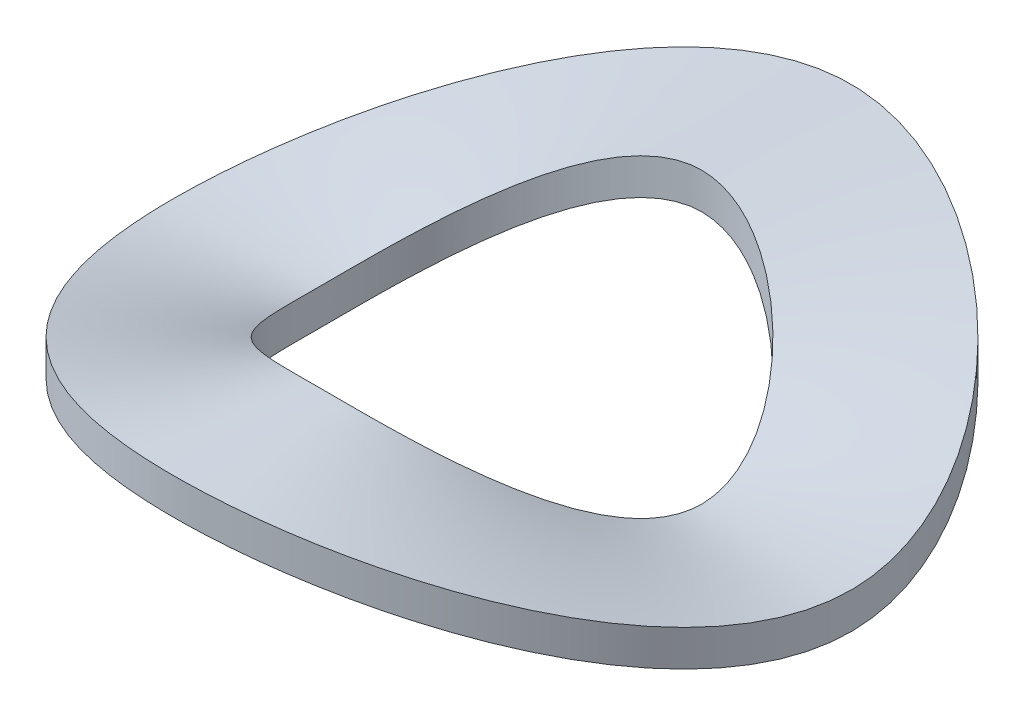
ISO-10303-21;
HEADER;
FILE_DESCRIPTION(('STEP AP214'),'2;1');
FILE_NAME('part.step','',(''),(''),'','','');
FILE_SCHEMA(('AUTOMOTIVE_DESIGN { 1 0 10303 214 1 1 1 1 }'));
ENDSEC;
DATA;
#1=APPLICATION_CONTEXT('core data for automotive mechanical design processes');
#2=APPLICATION_PROTOCOL_DEFINITION('international standard','automotive_design',2000,#1);
#3=PRODUCT_CONTEXT('',#1,'mechanical');
#4=PRODUCT('Part','Part','',(#3));
#5=PRODUCT_RELATED_PRODUCT_CATEGORY('part','',(#4));
#6=PRODUCT_DEFINITION_FORMATION('','',#4);
#7=PRODUCT_DEFINITION_CONTEXT('part definition',#1,'design');
#8=PRODUCT_DEFINITION('design','',#6,#7);
#9=PRODUCT_DEFINITION_SHAPE('','',#8);
#10=(LENGTH_UNIT() NAMED_UNIT(*) SI_UNIT(.MILLI.,.METRE.));
#11=(NAMED_UNIT(*) PLANE_ANGLE_UNIT() SI_UNIT($,.RADIAN.));
#12=(NAMED_UNIT(*) SI_UNIT($,.STERADIAN.) SOLID_ANGLE_UNIT());
#13=UNCERTAINTY_MEASURE_WITH_UNIT(LENGTH_MEASURE(1.E-05),#10,'distance_accuracy_value','');
#14=(GEOMETRIC_REPRESENTATION_CONTEXT(3) GLOBAL_UNCERTAINTY_ASSIGNED_CONTEXT((#13)) GLOBAL_UNIT_ASSIGNED_CONTEXT((#10,
#11,#12)) REPRESENTATION_CONTEXT('',''));
#15=CARTESIAN_POINT('',(0.,0.,0.));
#16=DIRECTION('',(0.,0.,1.));
#17=DIRECTION('',(1.,0.,0.));
#18=AXIS2_PLACEMENT_3D('',#15,#16,#17);
#19=CARTESIAN_POINT('',(-4.2,0.8,0.));
#20=CARTESIAN_POINT('',(-4.20000000000264,0.799999999998755,-0.104999999999411));
#21=CARTESIAN_POINT('',(-4.18950000000846,0.810999999996081,-0.31499999999814));
#22=CARTESIAN_POINT('',(-4.14382500001857,0.857199999991654,-0.628424999996024));
#23=CARTESIAN_POINT('',(-4.06980000002988,0.929799999986951,-0.938699999993765));
#24=CARTESIAN_POINT('',(-3.46500000008107,1.50399999997936,-2.77200000004827));
#25=CARTESIAN_POINT('',(0.419999999789683,4.76000000000312,-5.87999999999378));
#26=CARTESIAN_POINT('',(6.30000000003531,-1.39999999996301,8.39617004394499E-11));
#27=CARTESIAN_POINT('',(0.419999999956076,4.75999999999689,5.88000000000151));
#28=CARTESIAN_POINT('',(-3.46499999996412,1.50400000002064,2.77199999999058));
#29=CARTESIAN_POINT('',(-4.06979999998262,0.929800000008906,0.938699999995853));
#30=CARTESIAN_POINT('',(-4.14382499998694,0.857200000006478,0.628424999996966));
#31=CARTESIAN_POINT('',(-4.1894999999926,0.811000000003549,0.314999999998328));
#32=CARTESIAN_POINT('',(-4.19999999999736,0.800000000001245,0.104999999999411));
#33=CARTESIAN_POINT('',(-4.2,0.8,0.));
#34=CARTESIAN_POINT('',(-4.2,0.733333333333334,0.));
#35=CARTESIAN_POINT('',(-4.20000000000264,0.733333333332089,-0.104999999999411));
#36=CARTESIAN_POINT('',(-4.18950000000846,0.744333333329415,-0.31499999999814));
#37=CARTESIAN_POINT('',(-4.14382500001857,0.790533333324988,-0.628424999996024));
#38=CARTESIAN_POINT('',(-4.06980000002988,0.863133333320284,-0.938699999993765));
#39=CARTESIAN_POINT('',(-3.46500000008107,1.4373333333127,-2.77200000004827));
#40=CARTESIAN_POINT('',(0.419999999789683,4.69333333333645,-5.87999999999378));
#41=CARTESIAN_POINT('',(6.30000000003531,-1.46666666662968,8.39617004394499E-11));
#42=CARTESIAN_POINT('',(0.419999999956076,4.69333333333022,5.88000000000151));
#43=CARTESIAN_POINT('',(-3.46499999996412,1.43733333335397,2.77199999999058));
#44=CARTESIAN_POINT('',(-4.06979999998262,0.86313333334224,0.938699999995853));
#45=CARTESIAN_POINT('',(-4.14382499998694,0.790533333339811,0.628424999996966));
#46=CARTESIAN_POINT('',(-4.1894999999926,0.744333333336883,0.314999999998328));
#47=CARTESIAN_POINT('',(-4.19999999999736,0.733333333334578,0.104999999999411));
#48=CARTESIAN_POINT('',(-4.2,0.733333333333334,0.));
#49=CARTESIAN_POINT('',(-4.2,0.600000000000001,0.));
#50=CARTESIAN_POINT('',(-4.20000000000264,0.599999999998756,-0.104999999999411));
#51=CARTESIAN_POINT('',(-4.18950000000846,0.610999999996081,-0.314999999998139));
#52=CARTESIAN_POINT('',(-4.14382500001857,0.657199999991654,-0.628424999996023));
#53=CARTESIAN_POINT('',(-4.06980000002988,0.729799999986951,-0.938699999993764));
#54=CARTESIAN_POINT('',(-3.46500000008107,1.30399999997936,-2.77200000004826));
#55=CARTESIAN_POINT('',(0.419999999789683,4.56000000000312,-5.87999999999378));
#56=CARTESIAN_POINT('',(6.30000000003531,-1.59999999996301,8.39619443849388E-11));
#57=CARTESIAN_POINT('',(0.419999999956076,4.55999999999689,5.8800000000015));
#58=CARTESIAN_POINT('',(-3.46499999996412,1.30400000002064,2.77199999999057));
#59=CARTESIAN_POINT('',(-4.06979999998262,0.729800000008907,0.938699999995852));
#60=CARTESIAN_POINT('',(-4.14382499998694,0.657200000006478,0.628424999996966));
#61=CARTESIAN_POINT('',(-4.1894999999926,0.61100000000355,0.314999999998328));
#62=CARTESIAN_POINT('',(-4.19999999999736,0.600000000001245,0.104999999999411));
#63=CARTESIAN_POINT('',(-4.2,0.600000000000001,0.));
#64=CARTESIAN_POINT('',(-4.20000000000001,0.400000000000001,0.));
#65=CARTESIAN_POINT('',(-4.20000000000265,0.399999999998756,-0.104999999999411));
#66=CARTESIAN_POINT('',(-4.18950000000846,0.410999999996082,-0.31499999999814));
#67=CARTESIAN_POINT('',(-4.14382500001858,0.457199999991655,-0.628424999996025));
#68=CARTESIAN_POINT('',(-4.06980000002988,0.529799999986951,-0.938699999993767));
#69=CARTESIAN_POINT('',(-3.46500000008108,1.10399999997936,-2.77200000004827));
#70=CARTESIAN_POINT('',(0.419999999789684,4.36000000000312,-5.87999999999379));
#71=CARTESIAN_POINT('',(6.30000000003532,-1.79999999996301,8.39617546495586E-11));
#72=CARTESIAN_POINT('',(0.419999999956077,4.35999999999689,5.88000000000152));
#73=CARTESIAN_POINT('',(-3.46499999996413,1.10400000002064,2.77199999999058));
#74=CARTESIAN_POINT('',(-4.06979999998263,0.529800000008907,0.938699999995855));
#75=CARTESIAN_POINT('',(-4.14382499998694,0.457200000006479,0.628424999996968));
#76=CARTESIAN_POINT('',(-4.18949999999261,0.41100000000355,0.314999999998329));
#77=CARTESIAN_POINT('',(-4.19999999999736,0.400000000001246,0.104999999999412));
#78=CARTESIAN_POINT('',(-4.20000000000001,0.400000000000001,0.));
#79=CARTESIAN_POINT('',(-4.2,0.2,0.));
#80=CARTESIAN_POINT('',(-4.20000000000264,0.199999999998756,-0.104999999999411));
#81=CARTESIAN_POINT('',(-4.18950000000845,0.210999999996081,-0.314999999998139));
#82=CARTESIAN_POINT('',(-4.14382500001857,0.257199999991654,-0.628424999996023));
#83=CARTESIAN_POINT('',(-4.06980000002987,0.329799999986951,-0.938699999993763));
#84=CARTESIAN_POINT('',(-3.46500000008107,0.903999999979364,-2.77200000004826));
#85=CARTESIAN_POINT('',(0.419999999789683,4.16000000000312,-5.87999999999377));
#86=CARTESIAN_POINT('',(6.3000000000353,-1.99999999996301,8.39620799102103E-11));
#87=CARTESIAN_POINT('',(0.419999999956076,4.15999999999689,5.8800000000015));
#88=CARTESIAN_POINT('',(-3.46499999996412,0.904000000020638,2.77199999999057));
#89=CARTESIAN_POINT('',(-4.06979999998262,0.329800000008907,0.938699999995852));
#90=CARTESIAN_POINT('',(-4.14382499998693,0.257200000006478,0.628424999996965));
#91=CARTESIAN_POINT('',(-4.1894999999926,0.211000000003549,0.314999999998327));
#92=CARTESIAN_POINT('',(-4.19999999999735,0.200000000001245,0.104999999999411));
#93=CARTESIAN_POINT('',(-4.2,0.2,0.));
#94=CARTESIAN_POINT('',(-4.2,0.0666666666666672,0.));
#95=CARTESIAN_POINT('',(-4.20000000000264,0.0666666666654225,-0.104999999999411));
#96=CARTESIAN_POINT('',(-4.18950000000846,0.0776666666627481,-0.31499999999814));
#97=CARTESIAN_POINT('',(-4.14382500001857,0.123866666658321,-0.628424999996024));
#98=CARTESIAN_POINT('',(-4.06980000002988,0.196466666653618,-0.938699999993765));
#99=CARTESIAN_POINT('',(-3.46500000008107,0.77066666664603,-2.77200000004826));
#100=CARTESIAN_POINT('',(0.419999999789683,4.02666666666978,-5.87999999999378));
#101=CARTESIAN_POINT('',(6.30000000003531,-2.13333333329634,8.39617817546129E-11));
#102=CARTESIAN_POINT('',(0.419999999956076,4.02666666666355,5.88000000000151));
#103=CARTESIAN_POINT('',(-3.46499999996412,0.770666666687305,2.77199999999058));
#104=CARTESIAN_POINT('',(-4.06979999998262,0.196466666675574,0.938699999995853));
#105=CARTESIAN_POINT('',(-4.14382499998694,0.123866666673145,0.628424999996966));
#106=CARTESIAN_POINT('',(-4.1894999999926,0.0776666666702162,0.314999999998328));
#107=CARTESIAN_POINT('',(-4.19999999999736,0.0666666666679119,0.104999999999411));
#108=CARTESIAN_POINT('',(-4.2,0.0666666666666672,0.));
#109=CARTESIAN_POINT('',(-4.2,0.,0.));
#110=CARTESIAN_POINT('',(-4.20000000000264,-1.24442988940344E-12,-0.104999999999411));
#111=CARTESIAN_POINT('',(-4.18950000000846,0.0109999999960812,-0.31499999999814));
#112=CARTESIAN_POINT('',(-4.14382500001857,0.057199999991654,-0.628424999996024));
#113=CARTESIAN_POINT('',(-4.06980000002988,0.129799999986951,-0.938699999993765));
#114=CARTESIAN_POINT('',(-3.46500000008107,0.703999999979363,-2.77200000004826));
#115=CARTESIAN_POINT('',(0.419999999789683,3.96000000000312,-5.87999999999378));
#116=CARTESIAN_POINT('',(6.30000000003531,-2.19999999996301,8.39617817546129E-11));
#117=CARTESIAN_POINT('',(0.419999999956076,3.95999999999689,5.88000000000151));
#118=CARTESIAN_POINT('',(-3.46499999996412,0.704000000020638,2.77199999999058));
#119=CARTESIAN_POINT('',(-4.06979999998262,0.129800000008907,0.938699999995853));
#120=CARTESIAN_POINT('',(-4.14382499998694,0.0572000000064783,0.628424999996966));
#121=CARTESIAN_POINT('',(-4.1894999999926,0.0110000000035493,0.314999999998328));
#122=CARTESIAN_POINT('',(-4.19999999999736,1.24494488543537E-12,0.104999999999411));
#123=CARTESIAN_POINT('',(-4.2,0.,0.));
#124=B_SPLINE_SURFACE_WITH_KNOTS('',3,3,((#19,#20,#21,#22,#23,#24,#25,#26,#27,#28,#29,#30,#31,
#32,#33),(#34,#35,#36,#37,#38,#39,#40,#41,#42,#43,#44,#45,#46,#47,#48),(#49,#50,#51,#52,#53,#54,
#55,#56,#57,#58,#59,#60,#61,#62,#63),(#64,#65,#66,#67,#68,#69,#70,#71,#72,#73,#74,#75,#76,#77,
#78),(#79,#80,#81,#82,#83,#84,#85,#86,#87,#88,#89,#90,#91,#92,#93),(#94,#95,#96,#97,#98,#99,
#100,#101,#102,#103,#104,#105,#106,#107,#108),(#109,#110,#111,#112,#113,#114,#115,#116,#117,
#118,#119,#120,#121,#122,#123)),.UNSPECIFIED.,.F.,.T.,.F.,(4,1,1,1,4),(4,1,1,1,1,1,1,1,1,1,1,1,
4),(0.836734693877551,0.877551020408163,0.918367346938775,0.959183673469388,1.),(0.,0.0125,
0.0249999999999999,0.0375000000000001,0.05,0.250000000008407,0.500000000000158,0.75,0.95,0.9625,
0.975,0.9875,1.),.UNSPECIFIED.);
#125=CARTESIAN_POINT('',(-4.2,0.,0.));
#126=CARTESIAN_POINT('',(-4.20000000000264,-1.24442988940344E-12,-0.104999999999411));
#127=CARTESIAN_POINT('',(-4.18950000000846,0.0109999999960812,-0.31499999999814));
#128=CARTESIAN_POINT('',(-4.14382500001857,0.057199999991654,-0.628424999996024));
#129=CARTESIAN_POINT('',(-4.06980000002988,0.129799999986951,-0.938699999993765));
#130=CARTESIAN_POINT('',(-3.46500000008107,0.703999999979363,-2.77200000004826));
#131=CARTESIAN_POINT('',(0.419999999789683,3.96000000000312,-5.87999999999378));
#132=CARTESIAN_POINT('',(6.30000000003531,-2.19999999996301,8.39617817546129E-11));
#133=CARTESIAN_POINT('',(0.419999999956076,3.95999999999689,5.88000000000151));
#134=CARTESIAN_POINT('',(-3.46499999996412,0.704000000020638,2.77199999999058));
#135=CARTESIAN_POINT('',(-4.06979999998262,0.129800000008907,0.938699999995853));
#136=CARTESIAN_POINT('',(-4.14382499998694,0.0572000000064783,0.628424999996966));
#137=CARTESIAN_POINT('',(-4.1894999999926,0.0110000000035493,0.314999999998328));
#138=CARTESIAN_POINT('',(-4.19999999999736,1.24494488543537E-12,0.104999999999411));
#139=CARTESIAN_POINT('',(-4.2,0.,0.));
#140=B_SPLINE_CURVE_WITH_KNOTS('',3,(#125,#126,#127,#128,#129,#130,#131,#132,#133,#134,#135,
#136,#137,#138,#139),.UNSPECIFIED.,.T.,.F.,(4,1,1,1,1,1,1,1,1,1,1,1,4),(0.,0.0125,
0.0249999999999999,0.0375000000000001,0.05,0.250000000008407,0.500000000000158,0.75,0.95,0.9625,
0.975,0.9875,1.),.UNSPECIFIED.);
#141=CARTESIAN_POINT('',(-4.2,0.,0.));
#142=VERTEX_POINT('',#141);
#143=EDGE_CURVE('E11',#142,#142,#140,.T.);
#144=CARTESIAN_POINT('',(-4.2,0.8,0.));
#145=CARTESIAN_POINT('',(-4.20000000000264,0.799999999998755,-0.104999999999411));
#146=CARTESIAN_POINT('',(-4.18950000000846,0.810999999996081,-0.31499999999814));
#147=CARTESIAN_POINT('',(-4.14382500001857,0.857199999991654,-0.628424999996024));
#148=CARTESIAN_POINT('',(-4.06980000002988,0.929799999986951,-0.938699999993765));
#149=CARTESIAN_POINT('',(-3.46500000008107,1.50399999997936,-2.77200000004827));
#150=CARTESIAN_POINT('',(0.419999999789683,4.76000000000312,-5.87999999999378));
#151=CARTESIAN_POINT('',(6.30000000003531,-1.39999999996301,8.39617004394499E-11));
#152=CARTESIAN_POINT('',(0.419999999956076,4.75999999999689,5.88000000000151));
#153=CARTESIAN_POINT('',(-3.46499999996412,1.50400000002064,2.77199999999058));
#154=CARTESIAN_POINT('',(-4.06979999998262,0.929800000008906,0.938699999995853));
#155=CARTESIAN_POINT('',(-4.14382499998694,0.857200000006478,0.628424999996966));
#156=CARTESIAN_POINT('',(-4.1894999999926,0.811000000003549,0.314999999998328));
#157=CARTESIAN_POINT('',(-4.19999999999736,0.800000000001245,0.104999999999411));
#158=CARTESIAN_POINT('',(-4.2,0.8,0.));
#159=B_SPLINE_CURVE_WITH_KNOTS('',3,(#144,#145,#146,#147,#148,#149,#150,#151,#152,#153,#154,
#155,#156,#157,#158),.UNSPECIFIED.,.T.,.F.,(4,1,1,1,1,1,1,1,1,1,1,1,4),(0.,0.0125,
0.0249999999999999,0.0375000000000001,0.05,0.250000000008407,0.500000000000158,0.75,0.95,0.9625,
0.975,0.9875,1.),.UNSPECIFIED.);
#160=CARTESIAN_POINT('',(-4.2,0.8,0.));
#161=VERTEX_POINT('',#160);
#162=EDGE_CURVE('E59',#161,#161,#159,.T.);
#163=ORIENTED_EDGE('',*,*,#143,.T.);
#164=EDGE_LOOP('',(#163));
#165=FACE_BOUND('',#164,.T.);
#166=ORIENTED_EDGE('',*,*,#162,.F.);
#167=EDGE_LOOP('',(#166));
#168=FACE_BOUND('',#167,.T.);
#169=ADVANCED_FACE('F48',(#165,#168),#124,.T.);
#170=CARTESIAN_POINT('',(-7.5,0.800000000000001,0.));
#171=CARTESIAN_POINT('',(-7.50000000000472,0.799999999998756,-0.187499999998948));
#172=CARTESIAN_POINT('',(-7.4812500000151,0.810999999996081,-0.562499999996679));
#173=CARTESIAN_POINT('',(-7.39968750003316,0.857199999991654,-1.1221874999929));
#174=CARTESIAN_POINT('',(-7.26750000005335,0.929799999986951,-1.67624999998887));
#175=CARTESIAN_POINT('',(-6.18750000014477,1.50399999997936,-4.95000000008619));
#176=CARTESIAN_POINT('',(0.749999999624434,4.76000000000312,-10.4999999999889));
#177=CARTESIAN_POINT('',(11.2500000000631,-1.39999999996301,1.49931662137698E-10));
#178=CARTESIAN_POINT('',(0.749999999921565,4.75999999999689,10.5000000000027));
#179=CARTESIAN_POINT('',(-6.18749999993593,1.50400000002064,4.94999999998317));
#180=CARTESIAN_POINT('',(-7.26749999996897,0.929800000008907,1.67624999999259));
#181=CARTESIAN_POINT('',(-7.39968749997667,0.857200000006478,1.12218749999458));
#182=CARTESIAN_POINT('',(-7.48124999998678,0.81100000000355,0.562499999997013));
#183=CARTESIAN_POINT('',(-7.49999999999528,0.800000000001245,0.187499999998948));
#184=CARTESIAN_POINT('',(-7.5,0.800000000000001,0.));
#185=CARTESIAN_POINT('',(-7.225,0.800000000000001,0.));
#186=CARTESIAN_POINT('',(-7.22500000000454,0.799999999998756,-0.180624999998987));
#187=CARTESIAN_POINT('',(-7.20693750001455,0.810999999996081,-0.5418749999968));
#188=CARTESIAN_POINT('',(-7.12836562503195,0.857199999991654,-1.08104062499316));
#189=CARTESIAN_POINT('',(-7.00102500005139,0.929799999986951,-1.61478749998927));
#190=CARTESIAN_POINT('',(-5.96062500013947,1.50399999997936,-4.76850000008303));
#191=CARTESIAN_POINT('',(0.722499999638205,4.76000000000312,-10.1149999999893));
#192=CARTESIAN_POINT('',(10.8375000000607,-1.39999999996301,1.44434865543414E-10));
#193=CARTESIAN_POINT('',(0.722499999924441,4.75999999999689,10.1150000000026));
#194=CARTESIAN_POINT('',(-5.96062499993828,1.50400000002064,4.76849999998379));
#195=CARTESIAN_POINT('',(-7.00102499997011,0.929800000008907,1.61478749999287));
#196=CARTESIAN_POINT('',(-7.12836562497753,0.857200000006478,1.08104062499478));
#197=CARTESIAN_POINT('',(-7.20693749998727,0.81100000000355,0.541874999997123));
#198=CARTESIAN_POINT('',(-7.22499999999545,0.800000000001245,0.180624999998987));
#199=CARTESIAN_POINT('',(-7.225,0.800000000000001,0.));
#200=CARTESIAN_POINT('',(-6.675,0.8,0.));
#201=CARTESIAN_POINT('',(-6.6750000000042,0.799999999998755,-0.166874999999064));
#202=CARTESIAN_POINT('',(-6.65831250001344,0.810999999996081,-0.500624999997044));
#203=CARTESIAN_POINT('',(-6.58572187502952,0.857199999991654,-0.998746874993681));
#204=CARTESIAN_POINT('',(-6.46807500004748,0.929799999986951,-1.49186249999009));
#205=CARTESIAN_POINT('',(-5.50687500012885,1.50399999997936,-4.40550000007671));
#206=CARTESIAN_POINT('',(0.667499999665747,4.76000000000312,-9.34499999999012));
#207=CARTESIAN_POINT('',(10.0125000000561,-1.39999999996301,1.33439591841478E-10));
#208=CARTESIAN_POINT('',(0.667499999930193,4.75999999999689,9.3450000000024));
#209=CARTESIAN_POINT('',(-5.50687499994298,1.50400000002064,4.40549999998502));
#210=CARTESIAN_POINT('',(-6.46807499997238,0.929800000008906,1.49186249999341));
#211=CARTESIAN_POINT('',(-6.58572187497924,0.857200000006478,0.998746874995178));
#212=CARTESIAN_POINT('',(-6.65831249998824,0.811000000003549,0.500624999997342));
#213=CARTESIAN_POINT('',(-6.6749999999958,0.800000000001244,0.166874999999064));
#214=CARTESIAN_POINT('',(-6.675,0.8,0.));
#215=CARTESIAN_POINT('',(-5.85,0.800000000000001,0.));
#216=CARTESIAN_POINT('',(-5.85000000000368,0.799999999998757,-0.14624999999918));
#217=CARTESIAN_POINT('',(-5.83537500001178,0.810999999996082,-0.438749999997409));
#218=CARTESIAN_POINT('',(-5.77175625002586,0.857199999991655,-0.875306249994462));
#219=CARTESIAN_POINT('',(-5.66865000004161,0.929799999986951,-1.30747499999132));
#220=CARTESIAN_POINT('',(-4.82625000011292,1.50399999997936,-3.86100000006723));
#221=CARTESIAN_POINT('',(0.584999999707059,4.76000000000311,-8.18999999999134));
#222=CARTESIAN_POINT('',(8.77500000004918,-1.399999999963,1.16946545763302E-10));
#223=CARTESIAN_POINT('',(0.584999999938821,4.75999999999688,8.1900000000021));
#224=CARTESIAN_POINT('',(-4.82624999995002,1.50400000002064,3.86099999998688));
#225=CARTESIAN_POINT('',(-5.66864999997579,0.929800000008907,1.30747499999422));
#226=CARTESIAN_POINT('',(-5.7717562499818,0.857200000006479,0.875306249995774));
#227=CARTESIAN_POINT('',(-5.83537499998969,0.81100000000355,0.438749999997671));
#228=CARTESIAN_POINT('',(-5.84999999999632,0.800000000001246,0.14624999999918));
#229=CARTESIAN_POINT('',(-5.85,0.800000000000001,0.));
#230=CARTESIAN_POINT('',(-5.025,0.799999999999999,0.));
#231=CARTESIAN_POINT('',(-5.02500000000316,0.799999999998755,-0.125624999999295));
#232=CARTESIAN_POINT('',(-5.01243750001012,0.810999999996081,-0.376874999997774));
#233=CARTESIAN_POINT('',(-4.95779062502222,0.857199999991654,-0.751865624995242));
#234=CARTESIAN_POINT('',(-4.86922500003574,0.92979999998695,-1.12308749999254));
#235=CARTESIAN_POINT('',(-4.145625000097,1.50399999997936,-3.31650000005774));
#236=CARTESIAN_POINT('',(0.502499999748371,4.76000000000312,-7.03499999999256));
#237=CARTESIAN_POINT('',(7.53750000004225,-1.39999999996301,1.00454421256974E-10));
#238=CARTESIAN_POINT('',(0.502499999947448,4.75999999999689,7.0350000000018));
#239=CARTESIAN_POINT('',(-4.14562499995707,1.50400000002064,3.31649999998873));
#240=CARTESIAN_POINT('',(-4.86922499997921,0.929800000008906,1.12308749999504));
#241=CARTESIAN_POINT('',(-4.95779062498437,0.857200000006478,0.75186562499637));
#242=CARTESIAN_POINT('',(-5.01243749999115,0.811000000003549,0.376874999997999));
#243=CARTESIAN_POINT('',(-5.02499999999684,0.800000000001244,0.125624999999296));
#244=CARTESIAN_POINT('',(-5.025,0.799999999999999,0.));
#245=CARTESIAN_POINT('',(-4.475,0.8,0.));
#246=CARTESIAN_POINT('',(-4.47500000000282,0.799999999998755,-0.111874999999372));
#247=CARTESIAN_POINT('',(-4.46381250000901,0.810999999996081,-0.335624999998018));
#248=CARTESIAN_POINT('',(-4.41514687501979,0.857199999991654,-0.669571874995763));
#249=CARTESIAN_POINT('',(-4.33627500003183,0.929799999986951,-1.00016249999336));
#250=CARTESIAN_POINT('',(-3.69187500008638,1.50399999997936,-2.95350000005143));
#251=CARTESIAN_POINT('',(0.447499999775912,4.76000000000312,-6.26499999999338));
#252=CARTESIAN_POINT('',(6.71250000003763,-1.39999999996301,8.94593643954722E-11));
#253=CARTESIAN_POINT('',(0.447499999953201,4.75999999999689,6.26500000000161));
#254=CARTESIAN_POINT('',(-3.69187499996177,1.50400000002064,2.95349999998996));
#255=CARTESIAN_POINT('',(-4.33627499998149,0.929800000008906,1.00016249999558));
#256=CARTESIAN_POINT('',(-4.41514687498608,0.857200000006478,0.669571874996768));
#257=CARTESIAN_POINT('',(-4.46381249999212,0.811000000003549,0.335624999998219));
#258=CARTESIAN_POINT('',(-4.47499999999719,0.800000000001245,0.111874999999373));
#259=CARTESIAN_POINT('',(-4.475,0.8,0.));
#260=CARTESIAN_POINT('',(-4.2,0.8,0.));
#261=CARTESIAN_POINT('',(-4.20000000000264,0.799999999998755,-0.104999999999411));
#262=CARTESIAN_POINT('',(-4.18950000000846,0.810999999996081,-0.31499999999814));
#263=CARTESIAN_POINT('',(-4.14382500001857,0.857199999991654,-0.628424999996024));
#264=CARTESIAN_POINT('',(-4.06980000002988,0.929799999986951,-0.938699999993765));
#265=CARTESIAN_POINT('',(-3.46500000008107,1.50399999997936,-2.77200000004827));
#266=CARTESIAN_POINT('',(0.419999999789683,4.76000000000312,-5.87999999999378));
#267=CARTESIAN_POINT('',(6.30000000003531,-1.39999999996301,8.39617004394499E-11));
#268=CARTESIAN_POINT('',(0.419999999956076,4.75999999999689,5.88000000000151));
#269=CARTESIAN_POINT('',(-3.46499999996412,1.50400000002064,2.77199999999058));
#270=CARTESIAN_POINT('',(-4.06979999998262,0.929800000008906,0.938699999995853));
#271=CARTESIAN_POINT('',(-4.14382499998694,0.857200000006478,0.628424999996966));
#272=CARTESIAN_POINT('',(-4.1894999999926,0.811000000003549,0.314999999998328));
#273=CARTESIAN_POINT('',(-4.19999999999736,0.800000000001245,0.104999999999411));
#274=CARTESIAN_POINT('',(-4.2,0.8,0.));
#275=B_SPLINE_SURFACE_WITH_KNOTS('',3,3,((#170,#171,#172,#173,#174,#175,#176,#177,#178,#179,
#180,#181,#182,#183,#184),(#185,#186,#187,#188,#189,#190,#191,#192,#193,#194,#195,#196,#197,
#198,#199),(#200,#201,#202,#203,#204,#205,#206,#207,#208,#209,#210,#211,#212,#213,#214),(#215,
#216,#217,#218,#219,#220,#221,#222,#223,#224,#225,#226,#227,#228,#229),(#230,#231,#232,#233,
#234,#235,#236,#237,#238,#239,#240,#241,#242,#243,#244),(#245,#246,#247,#248,#249,#250,#251,
#252,#253,#254,#255,#256,#257,#258,#259),(#260,#261,#262,#263,#264,#265,#266,#267,#268,#269,
#270,#271,#272,#273,#274)),.UNSPECIFIED.,.F.,.T.,.F.,(4,1,1,1,4),(4,1,1,1,1,1,1,1,1,1,1,1,4),
(0.163265306122449,0.331632653061224,0.5,0.668367346938775,0.836734693877551),(0.,0.0125,
0.0249999999999999,0.0375000000000001,0.05,0.250000000008407,0.500000000000158,0.75,0.95,0.9625,
0.975,0.9875,1.),.UNSPECIFIED.);
#276=CARTESIAN_POINT('',(-7.5,0.800000000000001,0.));
#277=CARTESIAN_POINT('',(-7.50000000000472,0.799999999998756,-0.187499999998948));
#278=CARTESIAN_POINT('',(-7.4812500000151,0.810999999996081,-0.562499999996679));
#279=CARTESIAN_POINT('',(-7.39968750003316,0.857199999991654,-1.1221874999929));
#280=CARTESIAN_POINT('',(-7.26750000005335,0.929799999986951,-1.67624999998887));
#281=CARTESIAN_POINT('',(-6.18750000014477,1.50399999997936,-4.95000000008619));
#282=CARTESIAN_POINT('',(0.749999999624434,4.76000000000312,-10.4999999999889));
#283=CARTESIAN_POINT('',(11.2500000000631,-1.39999999996301,1.49931662137698E-10));
#284=CARTESIAN_POINT('',(0.749999999921565,4.75999999999689,10.5000000000027));
#285=CARTESIAN_POINT('',(-6.18749999993593,1.50400000002064,4.94999999998317));
#286=CARTESIAN_POINT('',(-7.26749999996897,0.929800000008907,1.67624999999259));
#287=CARTESIAN_POINT('',(-7.39968749997667,0.857200000006478,1.12218749999458));
#288=CARTESIAN_POINT('',(-7.48124999998678,0.81100000000355,0.562499999997013));
#289=CARTESIAN_POINT('',(-7.49999999999528,0.800000000001245,0.187499999998948));
#290=CARTESIAN_POINT('',(-7.5,0.800000000000001,0.));
#291=B_SPLINE_CURVE_WITH_KNOTS('',3,(#276,#277,#278,#279,#280,#281,#282,#283,#284,#285,#286,
#287,#288,#289,#290),.UNSPECIFIED.,.T.,.F.,(4,1,1,1,1,1,1,1,1,1,1,1,4),(0.,0.0125,
0.0249999999999999,0.0375000000000001,0.05,0.250000000008407,0.500000000000158,0.75,0.95,0.9625,
0.975,0.9875,1.),.UNSPECIFIED.);
#292=CARTESIAN_POINT('',(-7.5,0.800000000000001,0.));
#293=VERTEX_POINT('',#292);
#294=EDGE_CURVE('E63',#293,#293,#291,.T.);
#295=ORIENTED_EDGE('',*,*,#162,.T.);
#296=EDGE_LOOP('',(#295));
#297=FACE_BOUND('',#296,.T.);
#298=ORIENTED_EDGE('',*,*,#294,.F.);
#299=EDGE_LOOP('',(#298));
#300=FACE_BOUND('',#299,.T.);
#301=ADVANCED_FACE('F91',(#297,#300),#275,.T.);
#302=CARTESIAN_POINT('',(-7.5,0.,0.));
#303=CARTESIAN_POINT('',(-7.50000000000472,-1.24442988940344E-12,-0.187499999998948));
#304=CARTESIAN_POINT('',(-7.4812500000151,0.0109999999960812,-0.562499999996678));
#305=CARTESIAN_POINT('',(-7.39968750003316,0.057199999991654,-1.1221874999929));
#306=CARTESIAN_POINT('',(-7.26750000005335,0.129799999986951,-1.67624999998887));
#307=CARTESIAN_POINT('',(-6.18750000014477,0.703999999979363,-4.95000000008619));
#308=CARTESIAN_POINT('',(0.749999999624434,3.96000000000312,-10.4999999999889));
#309=CARTESIAN_POINT('',(11.2500000000631,-2.19999999996301,1.49931662137698E-10));
#310=CARTESIAN_POINT('',(0.749999999921565,3.95999999999689,10.5000000000027));
#311=CARTESIAN_POINT('',(-6.18749999993593,0.704000000020638,4.94999999998317));
#312=CARTESIAN_POINT('',(-7.26749999996897,0.129800000008907,1.6762499999926));
#313=CARTESIAN_POINT('',(-7.39968749997667,0.0572000000064783,1.12218749999458));
#314=CARTESIAN_POINT('',(-7.48124999998678,0.0110000000035493,0.562499999997014));
#315=CARTESIAN_POINT('',(-7.49999999999528,1.24494488543537E-12,0.187499999998949));
#316=CARTESIAN_POINT('',(-7.5,0.,0.));
#317=CARTESIAN_POINT('',(-7.5,0.0666666666666672,0.));
#318=CARTESIAN_POINT('',(-7.50000000000472,0.0666666666654225,-0.187499999998949));
#319=CARTESIAN_POINT('',(-7.4812500000151,0.0776666666627481,-0.562499999996679));
#320=CARTESIAN_POINT('',(-7.39968750003316,0.123866666658321,-1.1221874999929));
#321=CARTESIAN_POINT('',(-7.26750000005335,0.196466666653618,-1.67624999998887));
#322=CARTESIAN_POINT('',(-6.18750000014478,0.77066666664603,-4.95000000008619));
#323=CARTESIAN_POINT('',(0.749999999624435,4.02666666666978,-10.4999999999889));
#324=CARTESIAN_POINT('',(11.2500000000631,-2.13333333329634,1.49932041608458E-10));
#325=CARTESIAN_POINT('',(0.749999999921565,4.02666666666355,10.5000000000027));
#326=CARTESIAN_POINT('',(-6.18749999993593,0.770666666687305,4.94999999998317));
#327=CARTESIAN_POINT('',(-7.26749999996897,0.196466666675574,1.67624999999259));
#328=CARTESIAN_POINT('',(-7.39968749997667,0.123866666673145,1.12218749999458));
#329=CARTESIAN_POINT('',(-7.48124999998679,0.0776666666702162,0.562499999997013));
#330=CARTESIAN_POINT('',(-7.49999999999528,0.0666666666679119,0.187499999998948));
#331=CARTESIAN_POINT('',(-7.5,0.0666666666666672,0.));
#332=CARTESIAN_POINT('',(-7.50000000000001,0.2,0.));
#333=CARTESIAN_POINT('',(-7.50000000000473,0.199999999998756,-0.187499999998949));
#334=CARTESIAN_POINT('',(-7.48125000001511,0.210999999996081,-0.562499999996679));
#335=CARTESIAN_POINT('',(-7.39968750003317,0.257199999991654,-1.1221874999929));
#336=CARTESIAN_POINT('',(-7.26750000005336,0.329799999986951,-1.67624999998887));
#337=CARTESIAN_POINT('',(-6.18750000014478,0.903999999979365,-4.95000000008619));
#338=CARTESIAN_POINT('',(0.749999999624435,4.16000000000312,-10.4999999999889));
#339=CARTESIAN_POINT('',(11.2500000000631,-1.99999999996301,1.49932041608458E-10));
#340=CARTESIAN_POINT('',(0.749999999921566,4.15999999999689,10.5000000000027));
#341=CARTESIAN_POINT('',(-6.18749999993594,0.904000000020639,4.94999999998317));
#342=CARTESIAN_POINT('',(-7.26749999996898,0.329800000008907,1.67624999999259));
#343=CARTESIAN_POINT('',(-7.39968749997668,0.257200000006478,1.12218749999458));
#344=CARTESIAN_POINT('',(-7.4812499999868,0.211000000003549,0.562499999997013));
#345=CARTESIAN_POINT('',(-7.49999999999529,0.200000000001245,0.187499999998948));
#346=CARTESIAN_POINT('',(-7.50000000000001,0.2,0.));
#347=CARTESIAN_POINT('',(-7.5,0.400000000000001,0.));
#348=CARTESIAN_POINT('',(-7.50000000000472,0.399999999998756,-0.187499999998948));
#349=CARTESIAN_POINT('',(-7.4812500000151,0.410999999996082,-0.562499999996679));
#350=CARTESIAN_POINT('',(-7.39968750003316,0.457199999991654,-1.1221874999929));
#351=CARTESIAN_POINT('',(-7.26750000005335,0.529799999986951,-1.67624999998887));
#352=CARTESIAN_POINT('',(-6.18750000014477,1.10399999997936,-4.95000000008619));
#353=CARTESIAN_POINT('',(0.749999999624434,4.36000000000312,-10.4999999999889));
#354=CARTESIAN_POINT('',(11.2500000000631,-1.79999999996301,1.49932258448893E-10));
#355=CARTESIAN_POINT('',(0.749999999921565,4.35999999999689,10.5000000000027));
#356=CARTESIAN_POINT('',(-6.18749999993593,1.10400000002064,4.94999999998318));
#357=CARTESIAN_POINT('',(-7.26749999996897,0.529800000008907,1.6762499999926));
#358=CARTESIAN_POINT('',(-7.39968749997667,0.457200000006479,1.12218749999458));
#359=CARTESIAN_POINT('',(-7.48124999998678,0.41100000000355,0.562499999997014));
#360=CARTESIAN_POINT('',(-7.49999999999528,0.400000000001245,0.187499999998949));
#361=CARTESIAN_POINT('',(-7.5,0.400000000000001,0.));
#362=CARTESIAN_POINT('',(-7.5,0.600000000000001,0.));
#363=CARTESIAN_POINT('',(-7.50000000000472,0.599999999998756,-0.187499999998948));
#364=CARTESIAN_POINT('',(-7.4812500000151,0.610999999996082,-0.562499999996678));
#365=CARTESIAN_POINT('',(-7.39968750003316,0.657199999991655,-1.1221874999929));
#366=CARTESIAN_POINT('',(-7.26750000005335,0.729799999986951,-1.67624999998887));
#367=CARTESIAN_POINT('',(-6.18750000014478,1.30399999997936,-4.95000000008618));
#368=CARTESIAN_POINT('',(0.749999999624435,4.56000000000312,-10.4999999999889));
#369=CARTESIAN_POINT('',(11.2500000000631,-1.59999999996301,1.49931770557915E-10));
#370=CARTESIAN_POINT('',(0.749999999921565,4.55999999999689,10.5000000000027));
#371=CARTESIAN_POINT('',(-6.18749999993593,1.30400000002064,4.94999999998317));
#372=CARTESIAN_POINT('',(-7.26749999996897,0.729800000008907,1.67624999999259));
#373=CARTESIAN_POINT('',(-7.39968749997667,0.657200000006479,1.12218749999458));
#374=CARTESIAN_POINT('',(-7.48124999998679,0.61100000000355,0.562499999997014));
#375=CARTESIAN_POINT('',(-7.49999999999528,0.600000000001245,0.187499999998949));
#376=CARTESIAN_POINT('',(-7.5,0.600000000000001,0.));
#377=CARTESIAN_POINT('',(-7.5,0.733333333333334,0.));
#378=CARTESIAN_POINT('',(-7.50000000000472,0.733333333332089,-0.187499999998948));
#379=CARTESIAN_POINT('',(-7.4812500000151,0.744333333329414,-0.562499999996679));
#380=CARTESIAN_POINT('',(-7.39968750003316,0.790533333324987,-1.1221874999929));
#381=CARTESIAN_POINT('',(-7.26750000005335,0.863133333320284,-1.67624999998887));
#382=CARTESIAN_POINT('',(-6.18750000014477,1.4373333333127,-4.95000000008619));
#383=CARTESIAN_POINT('',(0.749999999624434,4.69333333333645,-10.4999999999889));
#384=CARTESIAN_POINT('',(11.2500000000631,-1.46666666662968,1.49931662137698E-10));
#385=CARTESIAN_POINT('',(0.749999999921565,4.69333333333022,10.5000000000027));
#386=CARTESIAN_POINT('',(-6.18749999993593,1.43733333335397,4.94999999998317));
#387=CARTESIAN_POINT('',(-7.26749999996897,0.86313333334224,1.67624999999259));
#388=CARTESIAN_POINT('',(-7.39968749997667,0.790533333339811,1.12218749999458));
#389=CARTESIAN_POINT('',(-7.48124999998678,0.744333333336883,0.562499999997013));
#390=CARTESIAN_POINT('',(-7.49999999999528,0.733333333334578,0.187499999998948));
#391=CARTESIAN_POINT('',(-7.5,0.733333333333334,0.));
#392=CARTESIAN_POINT('',(-7.5,0.800000000000001,0.));
#393=CARTESIAN_POINT('',(-7.50000000000472,0.799999999998756,-0.187499999998948));
#394=CARTESIAN_POINT('',(-7.4812500000151,0.810999999996081,-0.562499999996679));
#395=CARTESIAN_POINT('',(-7.39968750003316,0.857199999991654,-1.1221874999929));
#396=CARTESIAN_POINT('',(-7.26750000005335,0.929799999986951,-1.67624999998887));
#397=CARTESIAN_POINT('',(-6.18750000014477,1.50399999997936,-4.95000000008619));
#398=CARTESIAN_POINT('',(0.749999999624434,4.76000000000312,-10.4999999999889));
#399=CARTESIAN_POINT('',(11.2500000000631,-1.39999999996301,1.49931662137698E-10));
#400=CARTESIAN_POINT('',(0.749999999921565,4.75999999999689,10.5000000000027));
#401=CARTESIAN_POINT('',(-6.18749999993593,1.50400000002064,4.94999999998317));
#402=CARTESIAN_POINT('',(-7.26749999996897,0.929800000008907,1.67624999999259));
#403=CARTESIAN_POINT('',(-7.39968749997667,0.857200000006478,1.12218749999458));
#404=CARTESIAN_POINT('',(-7.48124999998678,0.81100000000355,0.562499999997013));
#405=CARTESIAN_POINT('',(-7.49999999999528,0.800000000001245,0.187499999998948));
#406=CARTESIAN_POINT('',(-7.5,0.800000000000001,0.));
#407=B_SPLINE_SURFACE_WITH_KNOTS('',3,3,((#302,#303,#304,#305,#306,#307,#308,#309,#310,#311,
#312,#313,#314,#315,#316),(#317,#318,#319,#320,#321,#322,#323,#324,#325,#326,#327,#328,#329,
#330,#331),(#332,#333,#334,#335,#336,#337,#338,#339,#340,#341,#342,#343,#344,#345,#346),(#347,
#348,#349,#350,#351,#352,#353,#354,#355,#356,#357,#358,#359,#360,#361),(#362,#363,#364,#365,
#366,#367,#368,#369,#370,#371,#372,#373,#374,#375,#376),(#377,#378,#379,#380,#381,#382,#383,
#384,#385,#386,#387,#388,#389,#390,#391),(#392,#393,#394,#395,#396,#397,#398,#399,#400,#401,
#402,#403,#404,#405,#406)),.UNSPECIFIED.,.F.,.T.,.F.,(4,1,1,1,4),(4,1,1,1,1,1,1,1,1,1,1,1,4),
(0.,0.0408163265306122,0.0816326530612245,0.122448979591837,0.163265306122449),(0.,0.0125,
0.0249999999999999,0.0375000000000001,0.05,0.250000000008407,0.500000000000158,0.75,0.95,0.9625,
0.975,0.9875,1.),.UNSPECIFIED.);
#408=CARTESIAN_POINT('',(-7.5,0.,0.));
#409=CARTESIAN_POINT('',(-7.50000000000472,-1.24442988940344E-12,-0.187499999998948));
#410=CARTESIAN_POINT('',(-7.4812500000151,0.0109999999960812,-0.562499999996678));
#411=CARTESIAN_POINT('',(-7.39968750003316,0.057199999991654,-1.1221874999929));
#412=CARTESIAN_POINT('',(-7.26750000005335,0.129799999986951,-1.67624999998887));
#413=CARTESIAN_POINT('',(-6.18750000014477,0.703999999979363,-4.95000000008619));
#414=CARTESIAN_POINT('',(0.749999999624434,3.96000000000312,-10.4999999999889));
#415=CARTESIAN_POINT('',(11.2500000000631,-2.19999999996301,1.49931662137698E-10));
#416=CARTESIAN_POINT('',(0.749999999921565,3.95999999999689,10.5000000000027));
#417=CARTESIAN_POINT('',(-6.18749999993593,0.704000000020638,4.94999999998317));
#418=CARTESIAN_POINT('',(-7.26749999996897,0.129800000008907,1.6762499999926));
#419=CARTESIAN_POINT('',(-7.39968749997667,0.0572000000064783,1.12218749999458));
#420=CARTESIAN_POINT('',(-7.48124999998678,0.0110000000035493,0.562499999997014));
#421=CARTESIAN_POINT('',(-7.49999999999528,1.24494488543537E-12,0.187499999998949));
#422=CARTESIAN_POINT('',(-7.5,0.,0.));
#423=B_SPLINE_CURVE_WITH_KNOTS('',3,(#408,#409,#410,#411,#412,#413,#414,#415,#416,#417,#418,
#419,#420,#421,#422),.UNSPECIFIED.,.T.,.F.,(4,1,1,1,1,1,1,1,1,1,1,1,4),(0.,0.0125,
0.0249999999999999,0.0375000000000001,0.05,0.250000000008407,0.500000000000158,0.75,0.95,0.9625,
0.975,0.9875,1.),.UNSPECIFIED.);
#424=CARTESIAN_POINT('',(-7.5,0.,0.));
#425=VERTEX_POINT('',#424);
#426=EDGE_CURVE('E67',#425,#425,#423,.T.);
#427=ORIENTED_EDGE('',*,*,#294,.T.);
#428=EDGE_LOOP('',(#427));
#429=FACE_BOUND('',#428,.T.);
#430=ORIENTED_EDGE('',*,*,#426,.F.);
#431=EDGE_LOOP('',(#430));
#432=FACE_BOUND('',#431,.T.);
#433=ADVANCED_FACE('F89',(#429,#432),#407,.T.);
#434=CARTESIAN_POINT('',(-4.2,0.,0.));
#435=CARTESIAN_POINT('',(-4.20000000000264,-1.24411013446585E-12,-0.104999999999411));
#436=CARTESIAN_POINT('',(-4.18950000000846,0.0109999999960815,-0.31499999999814));
#437=CARTESIAN_POINT('',(-4.14382500001857,0.0571999999916544,-0.628424999996024));
#438=CARTESIAN_POINT('',(-4.06980000002988,0.129799999986951,-0.938699999993765));
#439=CARTESIAN_POINT('',(-3.46500000008107,0.703999999979364,-2.77200000004826));
#440=CARTESIAN_POINT('',(0.419999999789683,3.96000000000312,-5.87999999999378));
#441=CARTESIAN_POINT('',(6.30000000003531,-2.19999999996301,8.39617817546129E-11));
#442=CARTESIAN_POINT('',(0.419999999956076,3.95999999999689,5.88000000000151));
#443=CARTESIAN_POINT('',(-3.46499999996412,0.704000000020638,2.77199999999058));
#444=CARTESIAN_POINT('',(-4.06979999998262,0.129800000008907,0.938699999995853));
#445=CARTESIAN_POINT('',(-4.14382499998694,0.0572000000064785,0.628424999996966));
#446=CARTESIAN_POINT('',(-4.1894999999926,0.0110000000035496,0.314999999998328));
#447=CARTESIAN_POINT('',(-4.19999999999736,1.24523118257155E-12,0.104999999999411));
#448=CARTESIAN_POINT('',(-4.2,0.,0.));
#449=CARTESIAN_POINT('',(-5.3,0.,0.));
#450=CARTESIAN_POINT('',(-5.30000000000333,-1.24411013446585E-12,-0.132499999999257));
#451=CARTESIAN_POINT('',(-5.28675000001067,0.0109999999960815,-0.397499999997653));
#452=CARTESIAN_POINT('',(-5.22911250002343,0.0571999999916544,-0.793012499994983));
#453=CARTESIAN_POINT('',(-5.1357000000377,0.129799999986951,-1.18454999999213));
#454=CARTESIAN_POINT('',(-4.37250000010231,0.703999999979364,-3.49800000006091));
#455=CARTESIAN_POINT('',(0.5299999997346,3.96000000000312,-7.41999999999216));
#456=CARTESIAN_POINT('',(7.95000000004456,-2.19999999996301,1.05952031002887E-10));
#457=CARTESIAN_POINT('',(0.529999999944572,3.95999999999689,7.4200000000019));
#458=CARTESIAN_POINT('',(-4.37249999995472,0.704000000020638,3.49799999998811));
#459=CARTESIAN_POINT('',(-5.13569999997807,0.129800000008907,1.18454999999477));
#460=CARTESIAN_POINT('',(-5.22911249998351,0.0572000000064785,0.793012499996171));
#461=CARTESIAN_POINT('',(-5.28674999999066,0.0110000000035496,0.39749999999789));
#462=CARTESIAN_POINT('',(-5.29999999999666,1.24523118257155E-12,0.132499999999257));
#463=CARTESIAN_POINT('',(-5.3,0.,0.));
#464=CARTESIAN_POINT('',(-6.4,0.,0.));
#465=CARTESIAN_POINT('',(-6.40000000000403,-1.24442988940344E-12,-0.159999999999102));
#466=CARTESIAN_POINT('',(-6.38400000001289,0.0109999999960812,-0.479999999997165));
#467=CARTESIAN_POINT('',(-6.3144000000283,0.057199999991654,-0.957599999993941));
#468=CARTESIAN_POINT('',(-6.20160000004553,0.129799999986951,-1.4303999999905));
#469=CARTESIAN_POINT('',(-5.28000000012354,0.703999999979363,-4.22400000007355));
#470=CARTESIAN_POINT('',(0.639999999679518,3.96000000000312,-8.95999999999052));
#471=CARTESIAN_POINT('',(9.60000000005381,-2.19999999996301,1.27941873675347E-10));
#472=CARTESIAN_POINT('',(0.639999999933069,3.95999999999689,8.9600000000023));
#473=CARTESIAN_POINT('',(-5.27999999994533,0.704000000020638,4.22399999998564));
#474=CARTESIAN_POINT('',(-6.20159999997352,0.129800000008907,1.43039999999368));
#475=CARTESIAN_POINT('',(-6.31439999998009,0.0572000000064783,0.957599999995377));
#476=CARTESIAN_POINT('',(-6.38399999998872,0.0110000000035493,0.479999999997452));
#477=CARTESIAN_POINT('',(-6.39999999999597,1.24494488543537E-12,0.159999999999103));
#478=CARTESIAN_POINT('',(-6.4,0.,0.));
#479=CARTESIAN_POINT('',(-7.5,0.,0.));
#480=CARTESIAN_POINT('',(-7.50000000000472,-1.24442988940344E-12,-0.187499999998948));
#481=CARTESIAN_POINT('',(-7.4812500000151,0.0109999999960812,-0.562499999996678));
#482=CARTESIAN_POINT('',(-7.39968750003316,0.057199999991654,-1.1221874999929));
#483=CARTESIAN_POINT('',(-7.26750000005335,0.129799999986951,-1.67624999998887));
#484=CARTESIAN_POINT('',(-6.18750000014477,0.703999999979363,-4.95000000008619));
#485=CARTESIAN_POINT('',(0.749999999624434,3.96000000000312,-10.4999999999889));
#486=CARTESIAN_POINT('',(11.2500000000631,-2.19999999996301,1.49931662137698E-10));
#487=CARTESIAN_POINT('',(0.749999999921565,3.95999999999689,10.5000000000027));
#488=CARTESIAN_POINT('',(-6.18749999993593,0.704000000020638,4.94999999998317));
#489=CARTESIAN_POINT('',(-7.26749999996897,0.129800000008907,1.6762499999926));
#490=CARTESIAN_POINT('',(-7.39968749997667,0.0572000000064783,1.12218749999458));
#491=CARTESIAN_POINT('',(-7.48124999998678,0.0110000000035493,0.562499999997014));
#492=CARTESIAN_POINT('',(-7.49999999999528,1.24494488543537E-12,0.187499999998949));
#493=CARTESIAN_POINT('',(-7.5,0.,0.));
#494=B_SPLINE_SURFACE_WITH_KNOTS('',3,3,((#434,#435,#436,#437,#438,#439,#440,#441,#442,#443,
#444,#445,#446,#447,#448),(#449,#450,#451,#452,#453,#454,#455,#456,#457,#458,#459,#460,#461,
#462,#463),(#464,#465,#466,#467,#468,#469,#470,#471,#472,#473,#474,#475,#476,#477,#478),(#479,
#480,#481,#482,#483,#484,#485,#486,#487,#488,#489,#490,#491,#492,#493)),.UNSPECIFIED.,.F.,.T.,
.F.,(4,4),(4,1,1,1,1,1,1,1,1,1,1,1,4),(0.,1.),(0.,0.0125,0.0249999999999999,0.0375000000000001,
0.05,0.250000000008407,0.500000000000158,0.75,0.95,0.9625,0.975,0.9875,1.),.UNSPECIFIED.);
#495=ORIENTED_EDGE('',*,*,#143,.F.);
#496=EDGE_LOOP('',(#495));
#497=FACE_BOUND('',#496,.T.);
#498=ORIENTED_EDGE('',*,*,#426,.T.);
#499=EDGE_LOOP('',(#498));
#500=FACE_BOUND('',#499,.T.);
#501=ADVANCED_FACE('F50',(#497,#500),#494,.T.);
#502=CLOSED_SHELL('',(#169,#301,#433,#501));
#503=MANIFOLD_SOLID_BREP('B2',#502);
#504=ADVANCED_BREP_SHAPE_REPRESENTATION('',(#18,#503),#14);
#505=SHAPE_DEFINITION_REPRESENTATION(#9,#504);
ENDSEC;
END-ISO-10303-21;
